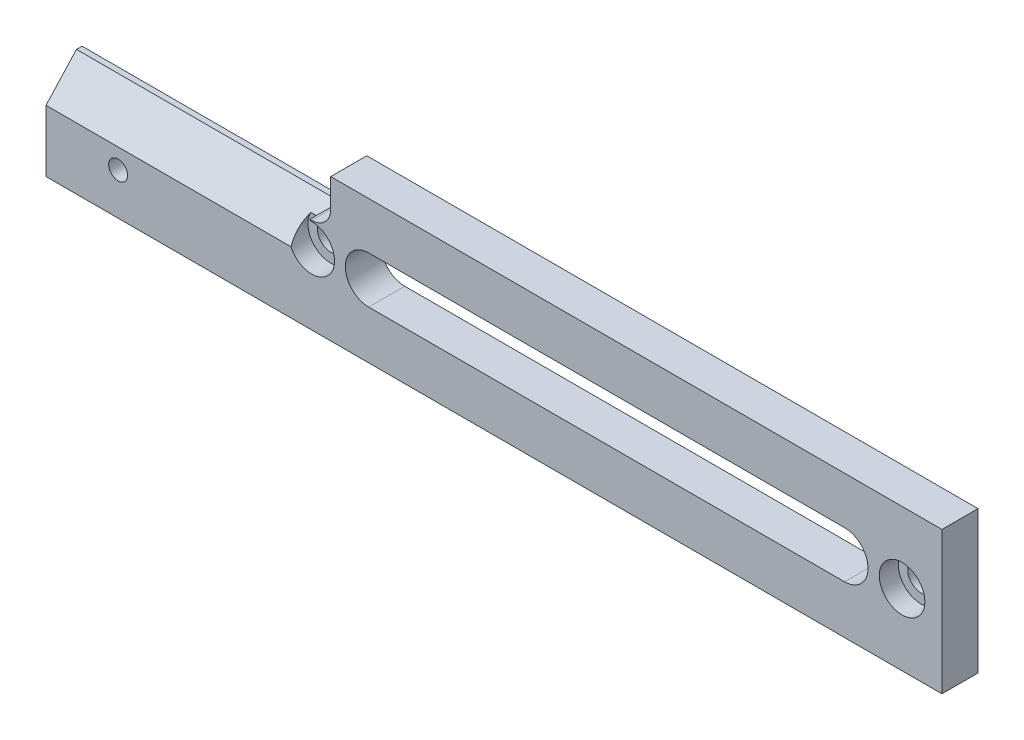
ISO-10303-21;
HEADER;
FILE_DESCRIPTION(('STEP AP214'),'2;1');
FILE_NAME('part.step','',(''),(''),'','','');
FILE_SCHEMA(('AUTOMOTIVE_DESIGN { 1 0 10303 214 1 1 1 1 }'));
ENDSEC;
DATA;
#1=APPLICATION_CONTEXT('core data for automotive mechanical design processes');
#2=APPLICATION_PROTOCOL_DEFINITION('international standard','automotive_design',2000,#1);
#3=PRODUCT_CONTEXT('',#1,'mechanical');
#4=PRODUCT('Part','Part','',(#3));
#5=PRODUCT_RELATED_PRODUCT_CATEGORY('part','',(#4));
#6=PRODUCT_DEFINITION_FORMATION('','',#4);
#7=PRODUCT_DEFINITION_CONTEXT('part definition',#1,'design');
#8=PRODUCT_DEFINITION('design','',#6,#7);
#9=PRODUCT_DEFINITION_SHAPE('','',#8);
#10=(LENGTH_UNIT() NAMED_UNIT(*) SI_UNIT(.MILLI.,.METRE.));
#11=(NAMED_UNIT(*) PLANE_ANGLE_UNIT() SI_UNIT($,.RADIAN.));
#12=(NAMED_UNIT(*) SI_UNIT($,.STERADIAN.) SOLID_ANGLE_UNIT());
#13=UNCERTAINTY_MEASURE_WITH_UNIT(LENGTH_MEASURE(1.E-05),#10,'distance_accuracy_value','');
#14=(GEOMETRIC_REPRESENTATION_CONTEXT(3) GLOBAL_UNCERTAINTY_ASSIGNED_CONTEXT((#13)) GLOBAL_UNIT_ASSIGNED_CONTEXT((#10,
#11,#12)) REPRESENTATION_CONTEXT('',''));
#15=CARTESIAN_POINT('',(0.,0.,0.));
#16=DIRECTION('',(0.,0.,1.));
#17=DIRECTION('',(1.,0.,0.));
#18=AXIS2_PLACEMENT_3D('',#15,#16,#17);
#19=CARTESIAN_POINT('',(0.,19.05,4.826));
#20=DIRECTION('',(-1.,0.,0.));
#21=DIRECTION('',(0.,-1.,0.));
#22=AXIS2_PLACEMENT_3D('',#19,#20,#21);
#23=PLANE('',#22);
#24=DIRECTION('',(0.,1.,0.));
#25=VECTOR('',#24,1.);
#26=CARTESIAN_POINT('',(0.,19.05,0.));
#27=LINE('',#26,#25);
#28=CARTESIAN_POINT('',(0.,0.,0.));
#29=VERTEX_POINT('',#28);
#30=CARTESIAN_POINT('',(0.,19.05,0.));
#31=VERTEX_POINT('',#30);
#32=EDGE_CURVE('E228',#29,#31,#27,.T.);
#33=ORIENTED_EDGE('',*,*,#32,.T.);
#34=DIRECTION('',(0.,0.,-1.));
#35=VECTOR('',#34,1.);
#36=CARTESIAN_POINT('',(0.,19.05,4.826));
#37=LINE('',#36,#35);
#38=CARTESIAN_POINT('',(0.,19.05,4.826));
#39=VERTEX_POINT('',#38);
#40=EDGE_CURVE('E278',#39,#31,#37,.T.);
#41=ORIENTED_EDGE('',*,*,#40,.F.);
#42=DIRECTION('',(0.,1.,0.));
#43=VECTOR('',#42,1.);
#44=CARTESIAN_POINT('',(0.,19.05,4.826));
#45=LINE('',#44,#43);
#46=CARTESIAN_POINT('',(0.,0.,4.826));
#47=VERTEX_POINT('',#46);
#48=EDGE_CURVE('E230',#47,#39,#45,.T.);
#49=ORIENTED_EDGE('',*,*,#48,.F.);
#50=DIRECTION('',(0.,0.,-1.));
#51=VECTOR('',#50,1.);
#52=CARTESIAN_POINT('',(0.,0.,4.826));
#53=LINE('',#52,#51);
#54=EDGE_CURVE('E247',#47,#29,#53,.T.);
#55=ORIENTED_EDGE('',*,*,#54,.T.);
#56=EDGE_LOOP('',(#33,#41,#49,#55));
#57=FACE_BOUND('',#56,.T.);
#58=ADVANCED_FACE('F33',(#57),#23,.F.);
#59=CARTESIAN_POINT('',(-81.788,19.05,4.826));
#60=DIRECTION('',(0.,-1.,0.));
#61=DIRECTION('',(0.,0.,-1.));
#62=AXIS2_PLACEMENT_3D('',#59,#60,#61);
#63=PLANE('',#62);
#64=DIRECTION('',(-1.,0.,0.));
#65=VECTOR('',#64,1.);
#66=CARTESIAN_POINT('',(-81.788,19.05,0.));
#67=LINE('',#66,#65);
#68=CARTESIAN_POINT('',(-81.788,19.05,0.));
#69=VERTEX_POINT('',#68);
#70=EDGE_CURVE('E250',#31,#69,#67,.T.);
#71=ORIENTED_EDGE('',*,*,#70,.T.);
#72=DIRECTION('',(0.,0.,-1.));
#73=VECTOR('',#72,1.);
#74=CARTESIAN_POINT('',(-81.788,19.05,4.826));
#75=LINE('',#74,#73);
#76=CARTESIAN_POINT('',(-81.788,19.05,4.826));
#77=VERTEX_POINT('',#76);
#78=EDGE_CURVE('E275',#77,#69,#75,.T.);
#79=ORIENTED_EDGE('',*,*,#78,.F.);
#80=DIRECTION('',(-1.,0.,0.));
#81=VECTOR('',#80,1.);
#82=CARTESIAN_POINT('',(-81.788,19.05,4.826));
#83=LINE('',#82,#81);
#84=EDGE_CURVE('E233',#39,#77,#83,.T.);
#85=ORIENTED_EDGE('',*,*,#84,.F.);
#86=ORIENTED_EDGE('',*,*,#40,.T.);
#87=EDGE_LOOP('',(#71,#79,#85,#86));
#88=FACE_BOUND('',#87,.T.);
#89=ADVANCED_FACE('F322',(#88),#63,.F.);
#90=CARTESIAN_POINT('',(-81.788,15.24,4.826));
#91=DIRECTION('',(1.,0.,0.));
#92=DIRECTION('',(0.,0.,-1.));
#93=AXIS2_PLACEMENT_3D('',#90,#91,#92);
#94=PLANE('',#93);
#95=DIRECTION('',(0.,-1.,0.));
#96=VECTOR('',#95,1.);
#97=CARTESIAN_POINT('',(-81.788,15.24,0.));
#98=LINE('',#97,#96);
#99=CARTESIAN_POINT('',(-81.788,15.24,0.));
#100=VERTEX_POINT('',#99);
#101=EDGE_CURVE('E252',#69,#100,#98,.T.);
#102=ORIENTED_EDGE('',*,*,#101,.T.);
#103=DIRECTION('',(0.,0.,-1.));
#104=VECTOR('',#103,1.);
#105=CARTESIAN_POINT('',(-81.788,15.24,4.826));
#106=LINE('',#105,#104);
#107=CARTESIAN_POINT('',(-81.788,15.24,4.826));
#108=VERTEX_POINT('',#107);
#109=EDGE_CURVE('E272',#108,#100,#106,.T.);
#110=ORIENTED_EDGE('',*,*,#109,.F.);
#111=DIRECTION('',(0.,-1.,0.));
#112=VECTOR('',#111,1.);
#113=CARTESIAN_POINT('',(-81.788,15.24,4.826));
#114=LINE('',#113,#112);
#115=EDGE_CURVE('E236',#77,#108,#114,.T.);
#116=ORIENTED_EDGE('',*,*,#115,.F.);
#117=ORIENTED_EDGE('',*,*,#78,.T.);
#118=EDGE_LOOP('',(#102,#110,#116,#117));
#119=FACE_BOUND('',#118,.T.);
#120=ADVANCED_FACE('F327',(#119),#94,.F.);
#121=CARTESIAN_POINT('',(-84.328,15.24,4.826));
#122=DIRECTION('',(0.,0.,-1.));
#123=DIRECTION('',(-1.,0.,0.));
#124=AXIS2_PLACEMENT_3D('',#121,#122,#123);
#125=CYLINDRICAL_SURFACE('',#124,2.54);
#126=CARTESIAN_POINT('',(-84.328,15.24,0.));
#127=DIRECTION('',(0.,0.,-1.));
#128=DIRECTION('',(1.,0.,0.));
#129=AXIS2_PLACEMENT_3D('',#126,#127,#128);
#130=CIRCLE('',#129,2.54);
#131=CARTESIAN_POINT('',(-84.328,12.7,0.));
#132=VERTEX_POINT('',#131);
#133=EDGE_CURVE('E254',#100,#132,#130,.T.);
#134=ORIENTED_EDGE('',*,*,#133,.T.);
#135=DIRECTION('',(0.,0.,-1.));
#136=VECTOR('',#135,1.);
#137=CARTESIAN_POINT('',(-84.328,12.7,4.826));
#138=LINE('',#137,#136);
#139=CARTESIAN_POINT('',(-84.328,12.7,4.826));
#140=VERTEX_POINT('',#139);
#141=EDGE_CURVE('E269',#140,#132,#138,.T.);
#142=ORIENTED_EDGE('',*,*,#141,.F.);
#143=CARTESIAN_POINT('',(-84.328,15.24,4.826));
#144=DIRECTION('',(0.,0.,-1.));
#145=DIRECTION('',(1.,0.,0.));
#146=AXIS2_PLACEMENT_3D('',#143,#144,#145);
#147=CIRCLE('',#146,2.54);
#148=EDGE_CURVE('E238',#108,#140,#147,.T.);
#149=ORIENTED_EDGE('',*,*,#148,.F.);
#150=ORIENTED_EDGE('',*,*,#109,.T.);
#151=EDGE_LOOP('',(#134,#142,#149,#150));
#152=FACE_BOUND('',#151,.T.);
#153=ADVANCED_FACE('F357',(#152),#125,.F.);
#154=CARTESIAN_POINT('',(-119.888,12.7,4.826));
#155=DIRECTION('',(0.,-1.,0.));
#156=DIRECTION('',(0.,0.,-1.));
#157=AXIS2_PLACEMENT_3D('',#154,#155,#156);
#158=PLANE('',#157);
#159=DIRECTION('',(0.,0.,-1.));
#160=VECTOR('',#159,1.);
#161=CARTESIAN_POINT('',(-119.888,12.7,4.826));
#162=LINE('',#161,#160);
#163=CARTESIAN_POINT('',(-119.888,12.7,0.749793550019733));
#164=VERTEX_POINT('',#163);
#165=CARTESIAN_POINT('',(-119.888,12.7,0.));
#166=VERTEX_POINT('',#165);
#167=EDGE_CURVE('E267',#164,#166,#162,.T.);
#168=ORIENTED_EDGE('',*,*,#167,.F.);
#169=DIRECTION('',(-1.,0.,0.));
#170=VECTOR('',#169,1.);
#171=CARTESIAN_POINT('',(-84.582,12.7,0.749793550019733));
#172=LINE('',#171,#170);
#173=CARTESIAN_POINT('',(-84.582,12.7,0.749793550019733));
#174=VERTEX_POINT('',#173);
#175=EDGE_CURVE('E223',#174,#164,#172,.T.);
#176=ORIENTED_EDGE('',*,*,#175,.F.);
#177=DIRECTION('',(0.,0.,-1.));
#178=VECTOR('',#177,1.);
#179=CARTESIAN_POINT('',(-84.582,12.7,4.826));
#180=LINE('',#179,#178);
#181=CARTESIAN_POINT('',(-84.582,12.7,4.826));
#182=VERTEX_POINT('',#181);
#183=EDGE_CURVE('E215',#182,#174,#180,.T.);
#184=ORIENTED_EDGE('',*,*,#183,.F.);
#185=DIRECTION('',(-1.,0.,0.));
#186=VECTOR('',#185,1.);
#187=CARTESIAN_POINT('',(-119.888,12.7,4.826));
#188=LINE('',#187,#186);
#189=EDGE_CURVE('E240',#140,#182,#188,.T.);
#190=ORIENTED_EDGE('',*,*,#189,.F.);
#191=ORIENTED_EDGE('',*,*,#141,.T.);
#192=DIRECTION('',(-1.,0.,0.));
#193=VECTOR('',#192,1.);
#194=CARTESIAN_POINT('',(-119.888,12.7,0.));
#195=LINE('',#194,#193);
#196=EDGE_CURVE('E256',#132,#166,#195,.T.);
#197=ORIENTED_EDGE('',*,*,#196,.T.);
#198=EDGE_LOOP('',(#168,#176,#184,#190,#191,#197));
#199=FACE_BOUND('',#198,.T.);
#200=ADVANCED_FACE('F350',(#199),#158,.F.);
#201=CARTESIAN_POINT('',(-119.888,0.,4.826));
#202=DIRECTION('',(1.,0.,0.));
#203=DIRECTION('',(0.,0.,-1.));
#204=AXIS2_PLACEMENT_3D('',#201,#202,#203);
#205=PLANE('',#204);
#206=DIRECTION('',(0.,-1.,0.));
#207=VECTOR('',#206,1.);
#208=CARTESIAN_POINT('',(-119.888,0.,4.826));
#209=LINE('',#208,#207);
#210=CARTESIAN_POINT('',(-119.888,8.25869508921998,4.826));
#211=VERTEX_POINT('',#210);
#212=CARTESIAN_POINT('',(-119.888,0.,4.826));
#213=VERTEX_POINT('',#212);
#214=EDGE_CURVE('E243',#211,#213,#209,.T.);
#215=ORIENTED_EDGE('',*,*,#214,.F.);
#216=DIRECTION('',(0.,-0.736740008018432,0.676176131333398));
#217=VECTOR('',#216,1.);
#218=CARTESIAN_POINT('',(-119.888,12.7,0.749793550019733));
#219=LINE('',#218,#217);
#220=EDGE_CURVE('E212',#164,#211,#219,.T.);
#221=ORIENTED_EDGE('',*,*,#220,.F.);
#222=ORIENTED_EDGE('',*,*,#167,.T.);
#223=DIRECTION('',(0.,-1.,0.));
#224=VECTOR('',#223,1.);
#225=CARTESIAN_POINT('',(-119.888,0.,0.));
#226=LINE('',#225,#224);
#227=CARTESIAN_POINT('',(-119.888,0.,0.));
#228=VERTEX_POINT('',#227);
#229=EDGE_CURVE('E259',#166,#228,#226,.T.);
#230=ORIENTED_EDGE('',*,*,#229,.T.);
#231=DIRECTION('',(0.,0.,-1.));
#232=VECTOR('',#231,1.);
#233=CARTESIAN_POINT('',(-119.888,0.,4.826));
#234=LINE('',#233,#232);
#235=EDGE_CURVE('E264',#213,#228,#234,.T.);
#236=ORIENTED_EDGE('',*,*,#235,.F.);
#237=EDGE_LOOP('',(#215,#221,#222,#230,#236));
#238=FACE_BOUND('',#237,.T.);
#239=ADVANCED_FACE('F316',(#238),#205,.F.);
#240=CARTESIAN_POINT('',(0.,0.,4.826));
#241=DIRECTION('',(0.,1.,0.));
#242=DIRECTION('',(-1.,0.,0.));
#243=AXIS2_PLACEMENT_3D('',#240,#241,#242);
#244=PLANE('',#243);
#245=DIRECTION('',(1.,0.,0.));
#246=VECTOR('',#245,1.);
#247=CARTESIAN_POINT('',(0.,0.,0.));
#248=LINE('',#247,#246);
#249=EDGE_CURVE('E234',#228,#29,#248,.T.);
#250=ORIENTED_EDGE('',*,*,#249,.T.);
#251=ORIENTED_EDGE('',*,*,#54,.F.);
#252=DIRECTION('',(1.,0.,0.));
#253=VECTOR('',#252,1.);
#254=CARTESIAN_POINT('',(0.,0.,4.826));
#255=LINE('',#254,#253);
#256=EDGE_CURVE('E245',#213,#47,#255,.T.);
#257=ORIENTED_EDGE('',*,*,#256,.F.);
#258=ORIENTED_EDGE('',*,*,#235,.T.);
#259=EDGE_LOOP('',(#250,#251,#257,#258));
#260=FACE_BOUND('',#259,.T.);
#261=ADVANCED_FACE('F307',(#260),#244,.F.);
#262=CARTESIAN_POINT('',(-84.328,15.24,4.826));
#263=DIRECTION('',(0.,0.,1.));
#264=DIRECTION('',(1.,0.,0.));
#265=AXIS2_PLACEMENT_3D('',#262,#263,#264);
#266=PLANE('',#265);
#267=CARTESIAN_POINT('',(-76.708,9.60500702074697,4.826));
#268=DIRECTION('',(0.,0.,1.));
#269=DIRECTION('',(1.,0.,0.));
#270=AXIS2_PLACEMENT_3D('',#267,#268,#269);
#271=CIRCLE('',#270,3.1369);
#272=CARTESIAN_POINT('',(-76.708,12.741907020747,4.826));
#273=VERTEX_POINT('',#272);
#274=CARTESIAN_POINT('',(-76.708,6.46810702074696,4.826));
#275=VERTEX_POINT('',#274);
#276=EDGE_CURVE('E47',#273,#275,#271,.T.);
#277=ORIENTED_EDGE('',*,*,#276,.F.);
#278=DIRECTION('',(-1.,0.,0.));
#279=VECTOR('',#278,1.);
#280=CARTESIAN_POINT('',(-76.708,12.741907020747,4.826));
#281=LINE('',#280,#279);
#282=CARTESIAN_POINT('',(-13.0302,12.741907020747,4.826));
#283=VERTEX_POINT('',#282);
#284=EDGE_CURVE('E162',#283,#273,#281,.T.);
#285=ORIENTED_EDGE('',*,*,#284,.F.);
#286=CARTESIAN_POINT('',(-13.0302,9.60500702074698,4.826));
#287=DIRECTION('',(0.,0.,1.));
#288=DIRECTION('',(1.,0.,0.));
#289=AXIS2_PLACEMENT_3D('',#286,#287,#288);
#290=CIRCLE('',#289,3.1369);
#291=CARTESIAN_POINT('',(-13.0302,6.46810702074698,4.826));
#292=VERTEX_POINT('',#291);
#293=EDGE_CURVE('E165',#292,#283,#290,.T.);
#294=ORIENTED_EDGE('',*,*,#293,.F.);
#295=DIRECTION('',(1.,0.,0.));
#296=VECTOR('',#295,1.);
#297=CARTESIAN_POINT('',(-13.0302,6.46810702074697,4.826));
#298=LINE('',#297,#296);
#299=EDGE_CURVE('E171',#275,#292,#298,.T.);
#300=ORIENTED_EDGE('',*,*,#299,.F.);
#301=EDGE_LOOP('',(#277,#285,#294,#300));
#302=FACE_BOUND('',#301,.T.);
#303=CARTESIAN_POINT('',(-110.236,5.58799999999998,4.826));
#304=DIRECTION('',(0.,0.,1.));
#305=DIRECTION('',(1.,0.,0.));
#306=AXIS2_PLACEMENT_3D('',#303,#304,#305);
#307=CIRCLE('',#306,1.26999999999999);
#308=CARTESIAN_POINT('',(-108.966,5.58799999999998,4.826));
#309=VERTEX_POINT('',#308);
#310=EDGE_CURVE('E177',#309,#309,#307,.T.);
#311=ORIENTED_EDGE('',*,*,#310,.F.);
#312=EDGE_LOOP('',(#311));
#313=FACE_BOUND('',#312,.T.);
#314=CARTESIAN_POINT('',(-84.328,9.525,4.826));
#315=DIRECTION('',(0.,0.,1.));
#316=DIRECTION('',(1.,0.,0.));
#317=AXIS2_PLACEMENT_3D('',#314,#315,#316);
#318=CIRCLE('',#317,3.048);
#319=CARTESIAN_POINT('',(-87.1005035388498,8.25869508921998,4.826));
#320=VERTEX_POINT('',#319);
#321=CARTESIAN_POINT('',(-84.582,12.5623982287478,4.826));
#322=VERTEX_POINT('',#321);
#323=EDGE_CURVE('E202',#320,#322,#318,.T.);
#324=ORIENTED_EDGE('',*,*,#323,.F.);
#325=DIRECTION('',(-1.,0.,0.));
#326=VECTOR('',#325,1.);
#327=CARTESIAN_POINT('',(-84.582,8.25869508921998,4.826));
#328=LINE('',#327,#326);
#329=EDGE_CURVE('E226',#320,#211,#328,.T.);
#330=ORIENTED_EDGE('',*,*,#329,.T.);
#331=ORIENTED_EDGE('',*,*,#214,.T.);
#332=ORIENTED_EDGE('',*,*,#256,.T.);
#333=ORIENTED_EDGE('',*,*,#48,.T.);
#334=ORIENTED_EDGE('',*,*,#84,.T.);
#335=ORIENTED_EDGE('',*,*,#115,.T.);
#336=ORIENTED_EDGE('',*,*,#148,.T.);
#337=ORIENTED_EDGE('',*,*,#189,.T.);
#338=DIRECTION('',(0.,1.,0.));
#339=VECTOR('',#338,1.);
#340=CARTESIAN_POINT('',(-84.582,8.25869508921998,4.826));
#341=LINE('',#340,#339);
#342=EDGE_CURVE('E221',#322,#182,#341,.T.);
#343=ORIENTED_EDGE('',*,*,#342,.F.);
#344=EDGE_LOOP('',(#324,#330,#331,#332,#333,#334,#335,#336,#337,#343));
#345=FACE_BOUND('',#344,.T.);
#346=CARTESIAN_POINT('',(-5.334,9.525,4.826));
#347=DIRECTION('',(0.,0.,1.));
#348=DIRECTION('',(1.,0.,0.));
#349=AXIS2_PLACEMENT_3D('',#346,#347,#348);
#350=CIRCLE('',#349,3.048);
#351=CARTESIAN_POINT('',(-2.286,9.525,4.826));
#352=VERTEX_POINT('',#351);
#353=EDGE_CURVE('E208',#352,#352,#350,.T.);
#354=ORIENTED_EDGE('',*,*,#353,.F.);
#355=EDGE_LOOP('',(#354));
#356=FACE_BOUND('',#355,.T.);
#357=ADVANCED_FACE('F305',(#302,#313,#345,#356),#266,.T.);
#358=CARTESIAN_POINT('',(-84.328,15.24,0.));
#359=DIRECTION('',(0.,0.,1.));
#360=DIRECTION('',(1.,0.,0.));
#361=AXIS2_PLACEMENT_3D('',#358,#359,#360);
#362=PLANE('',#361);
#363=DIRECTION('',(-1.,0.,0.));
#364=VECTOR('',#363,1.);
#365=CARTESIAN_POINT('',(-76.708,12.741907020747,0.));
#366=LINE('',#365,#364);
#367=CARTESIAN_POINT('',(-13.0302,12.741907020747,0.));
#368=VERTEX_POINT('',#367);
#369=CARTESIAN_POINT('',(-76.708,12.741907020747,0.));
#370=VERTEX_POINT('',#369);
#371=EDGE_CURVE('E152',#368,#370,#366,.T.);
#372=ORIENTED_EDGE('',*,*,#371,.T.);
#373=CARTESIAN_POINT('',(-76.708,9.60500702074697,0.));
#374=DIRECTION('',(0.,0.,1.));
#375=DIRECTION('',(1.,0.,0.));
#376=AXIS2_PLACEMENT_3D('',#373,#374,#375);
#377=CIRCLE('',#376,3.1369);
#378=CARTESIAN_POINT('',(-76.708,6.46810702074696,0.));
#379=VERTEX_POINT('',#378);
#380=EDGE_CURVE('E146',#370,#379,#377,.T.);
#381=ORIENTED_EDGE('',*,*,#380,.T.);
#382=DIRECTION('',(1.,0.,0.));
#383=VECTOR('',#382,1.);
#384=CARTESIAN_POINT('',(-13.0302,6.46810702074697,0.));
#385=LINE('',#384,#383);
#386=CARTESIAN_POINT('',(-13.0302,6.46810702074697,0.));
#387=VERTEX_POINT('',#386);
#388=EDGE_CURVE('E155',#379,#387,#385,.T.);
#389=ORIENTED_EDGE('',*,*,#388,.T.);
#390=CARTESIAN_POINT('',(-13.0302,9.60500702074698,0.));
#391=DIRECTION('',(0.,0.,1.));
#392=DIRECTION('',(1.,0.,0.));
#393=AXIS2_PLACEMENT_3D('',#390,#391,#392);
#394=CIRCLE('',#393,3.1369);
#395=EDGE_CURVE('E55',#387,#368,#394,.T.);
#396=ORIENTED_EDGE('',*,*,#395,.T.);
#397=EDGE_LOOP('',(#372,#381,#389,#396));
#398=FACE_BOUND('',#397,.T.);
#399=CARTESIAN_POINT('',(-110.236,5.58799999999998,0.));
#400=DIRECTION('',(0.,0.,1.));
#401=DIRECTION('',(1.,0.,0.));
#402=AXIS2_PLACEMENT_3D('',#399,#400,#401);
#403=CIRCLE('',#402,1.26999999999999);
#404=CARTESIAN_POINT('',(-108.966,5.58799999999998,0.));
#405=VERTEX_POINT('',#404);
#406=EDGE_CURVE('E181',#405,#405,#403,.T.);
#407=ORIENTED_EDGE('',*,*,#406,.T.);
#408=EDGE_LOOP('',(#407));
#409=FACE_BOUND('',#408,.T.);
#410=CARTESIAN_POINT('',(-84.328,9.525,0.));
#411=DIRECTION('',(0.,0.,1.));
#412=DIRECTION('',(1.,0.,0.));
#413=AXIS2_PLACEMENT_3D('',#410,#411,#412);
#414=CIRCLE('',#413,1.77800000000001);
#415=CARTESIAN_POINT('',(-82.55,9.525,0.));
#416=VERTEX_POINT('',#415);
#417=EDGE_CURVE('E184',#416,#416,#414,.T.);
#418=ORIENTED_EDGE('',*,*,#417,.T.);
#419=EDGE_LOOP('',(#418));
#420=FACE_BOUND('',#419,.T.);
#421=CARTESIAN_POINT('',(-5.334,9.525,0.));
#422=DIRECTION('',(0.,0.,1.));
#423=DIRECTION('',(1.,0.,0.));
#424=AXIS2_PLACEMENT_3D('',#421,#422,#423);
#425=CIRCLE('',#424,1.778);
#426=CARTESIAN_POINT('',(-3.556,9.525,0.));
#427=VERTEX_POINT('',#426);
#428=EDGE_CURVE('E195',#427,#427,#425,.T.);
#429=ORIENTED_EDGE('',*,*,#428,.T.);
#430=EDGE_LOOP('',(#429));
#431=FACE_BOUND('',#430,.T.);
#432=ORIENTED_EDGE('',*,*,#32,.F.);
#433=ORIENTED_EDGE('',*,*,#249,.F.);
#434=ORIENTED_EDGE('',*,*,#229,.F.);
#435=ORIENTED_EDGE('',*,*,#196,.F.);
#436=ORIENTED_EDGE('',*,*,#133,.F.);
#437=ORIENTED_EDGE('',*,*,#101,.F.);
#438=ORIENTED_EDGE('',*,*,#70,.F.);
#439=EDGE_LOOP('',(#432,#433,#434,#435,#436,#437,#438));
#440=FACE_BOUND('',#439,.T.);
#441=ADVANCED_FACE('F159',(#398,#409,#420,#431,#440),#362,.F.);
#442=CARTESIAN_POINT('',(-84.582,12.7,0.749793550019733));
#443=DIRECTION('',(0.,-0.676176131333398,-0.736740008018432));
#444=DIRECTION('',(0.,0.736740008018432,-0.676176131333398));
#445=AXIS2_PLACEMENT_3D('',#442,#443,#444);
#446=PLANE('',#445);
#447=DIRECTION('',(-1.,0.,0.));
#448=VECTOR('',#447,1.);
#449=CARTESIAN_POINT('',(-84.582,11.0261983086499,2.286));
#450=LINE('',#449,#448);
#451=CARTESIAN_POINT('',(-85.2807264235376,11.0261983086499,2.286));
#452=VERTEX_POINT('',#451);
#453=CARTESIAN_POINT('',(-86.980679331941,11.0261983086499,2.286));
#454=VERTEX_POINT('',#453);
#455=EDGE_CURVE('E201',#452,#454,#450,.T.);
#456=ORIENTED_EDGE('',*,*,#455,.F.);
#457=CARTESIAN_POINT('',(-84.328,9.525,3.66379196685312));
#458=DIRECTION('',(0.,-0.676176131333398,-0.736740008018432));
#459=DIRECTION('',(0.,-0.736740008018432,0.676176131333398));
#460=AXIS2_PLACEMENT_3D('',#457,#458,#459);
#461=ELLIPSE('',#460,2.41333439293217,1.77800000000001);
#462=CARTESIAN_POINT('',(-84.582,11.28476362049,2.04869010729128));
#463=VERTEX_POINT('',#462);
#464=EDGE_CURVE('E192',#452,#463,#461,.T.);
#465=ORIENTED_EDGE('',*,*,#464,.T.);
#466=DIRECTION('',(0.,-0.736740008018432,0.676176131333398));
#467=VECTOR('',#466,1.);
#468=CARTESIAN_POINT('',(-84.582,12.7,0.749793550019733));
#469=LINE('',#468,#467);
#470=EDGE_CURVE('E218',#174,#463,#469,.T.);
#471=ORIENTED_EDGE('',*,*,#470,.F.);
#472=ORIENTED_EDGE('',*,*,#175,.T.);
#473=ORIENTED_EDGE('',*,*,#220,.T.);
#474=ORIENTED_EDGE('',*,*,#329,.F.);
#475=CARTESIAN_POINT('',(-84.328,9.525,3.66379196685312));
#476=DIRECTION('',(0.,-0.676176131333398,-0.736740008018432));
#477=DIRECTION('',(0.,-0.736740008018432,0.676176131333398));
#478=AXIS2_PLACEMENT_3D('',#475,#476,#477);
#479=ELLIPSE('',#478,4.13714467359799,3.048);
#480=EDGE_CURVE('E205',#320,#454,#479,.T.);
#481=ORIENTED_EDGE('',*,*,#480,.T.);
#482=EDGE_LOOP('',(#456,#465,#471,#472,#473,#474,#481));
#483=FACE_BOUND('',#482,.T.);
#484=ADVANCED_FACE('F314',(#483),#446,.F.);
#485=CARTESIAN_POINT('',(-84.582,0.,0.));
#486=DIRECTION('',(1.,0.,0.));
#487=DIRECTION('',(0.,0.,-1.));
#488=AXIS2_PLACEMENT_3D('',#485,#486,#487);
#489=PLANE('',#488);
#490=ORIENTED_EDGE('',*,*,#470,.T.);
#491=DIRECTION('',(0.,0.,1.));
#492=VECTOR('',#491,1.);
#493=CARTESIAN_POINT('',(-84.582,11.28476362049,0.));
#494=LINE('',#493,#492);
#495=CARTESIAN_POINT('',(-84.582,11.28476362049,2.286));
#496=VERTEX_POINT('',#495);
#497=EDGE_CURVE('E189',#463,#496,#494,.T.);
#498=ORIENTED_EDGE('',*,*,#497,.T.);
#499=DIRECTION('',(0.,-1.,0.));
#500=VECTOR('',#499,1.);
#501=CARTESIAN_POINT('',(-84.582,0.,2.286));
#502=LINE('',#501,#500);
#503=CARTESIAN_POINT('',(-84.582,12.5623982287478,2.286));
#504=VERTEX_POINT('',#503);
#505=EDGE_CURVE('E281',#504,#496,#502,.T.);
#506=ORIENTED_EDGE('',*,*,#505,.F.);
#507=DIRECTION('',(0.,0.,1.));
#508=VECTOR('',#507,1.);
#509=CARTESIAN_POINT('',(-84.582,12.5623982287478,2.286));
#510=LINE('',#509,#508);
#511=EDGE_CURVE('E40',#504,#322,#510,.T.);
#512=ORIENTED_EDGE('',*,*,#511,.T.);
#513=ORIENTED_EDGE('',*,*,#342,.T.);
#514=ORIENTED_EDGE('',*,*,#183,.T.);
#515=EDGE_LOOP('',(#490,#498,#506,#512,#513,#514));
#516=FACE_BOUND('',#515,.T.);
#517=ADVANCED_FACE('F301',(#516),#489,.F.);
#518=CARTESIAN_POINT('',(-5.334,9.525,2.286));
#519=DIRECTION('',(0.,0.,1.));
#520=DIRECTION('',(1.,0.,0.));
#521=AXIS2_PLACEMENT_3D('',#518,#519,#520);
#522=CYLINDRICAL_SURFACE('',#521,3.048);
#523=CARTESIAN_POINT('',(-5.334,9.525,2.286));
#524=DIRECTION('',(0.,0.,1.));
#525=DIRECTION('',(1.,0.,0.));
#526=AXIS2_PLACEMENT_3D('',#523,#524,#525);
#527=CIRCLE('',#526,3.048);
#528=CARTESIAN_POINT('',(-2.286,9.525,2.286));
#529=VERTEX_POINT('',#528);
#530=EDGE_CURVE('E209',#529,#529,#527,.T.);
#531=ORIENTED_EDGE('',*,*,#530,.F.);
#532=EDGE_LOOP('',(#531));
#533=FACE_BOUND('',#532,.T.);
#534=ORIENTED_EDGE('',*,*,#353,.T.);
#535=EDGE_LOOP('',(#534));
#536=FACE_BOUND('',#535,.T.);
#537=ADVANCED_FACE('F295',(#533,#536),#522,.F.);
#538=CARTESIAN_POINT('',(-5.334,9.525,2.286));
#539=DIRECTION('',(0.,0.,1.));
#540=DIRECTION('',(1.,0.,0.));
#541=AXIS2_PLACEMENT_3D('',#538,#539,#540);
#542=PLANE('',#541);
#543=CARTESIAN_POINT('',(-5.334,9.525,2.286));
#544=DIRECTION('',(0.,0.,1.));
#545=DIRECTION('',(1.,0.,0.));
#546=AXIS2_PLACEMENT_3D('',#543,#544,#545);
#547=CIRCLE('',#546,1.778);
#548=CARTESIAN_POINT('',(-3.556,9.525,2.286));
#549=VERTEX_POINT('',#548);
#550=EDGE_CURVE('E198',#549,#549,#547,.T.);
#551=ORIENTED_EDGE('',*,*,#550,.F.);
#552=EDGE_LOOP('',(#551));
#553=FACE_BOUND('',#552,.T.);
#554=ORIENTED_EDGE('',*,*,#530,.T.);
#555=EDGE_LOOP('',(#554));
#556=FACE_BOUND('',#555,.T.);
#557=ADVANCED_FACE('F291',(#553,#556),#542,.T.);
#558=CARTESIAN_POINT('',(-84.328,9.525,2.286));
#559=DIRECTION('',(0.,0.,1.));
#560=DIRECTION('',(1.,0.,0.));
#561=AXIS2_PLACEMENT_3D('',#558,#559,#560);
#562=CYLINDRICAL_SURFACE('',#561,3.048);
#563=ORIENTED_EDGE('',*,*,#323,.T.);
#564=ORIENTED_EDGE('',*,*,#511,.F.);
#565=CARTESIAN_POINT('',(-84.328,9.525,2.286));
#566=DIRECTION('',(0.,0.,1.));
#567=DIRECTION('',(1.,0.,0.));
#568=AXIS2_PLACEMENT_3D('',#565,#566,#567);
#569=CIRCLE('',#568,3.048);
#570=EDGE_CURVE('E199',#454,#504,#569,.T.);
#571=ORIENTED_EDGE('',*,*,#570,.F.);
#572=ORIENTED_EDGE('',*,*,#480,.F.);
#573=EDGE_LOOP('',(#563,#564,#571,#572));
#574=FACE_BOUND('',#573,.T.);
#575=ADVANCED_FACE('F294',(#574),#562,.F.);
#576=CARTESIAN_POINT('',(-84.328,9.525,2.286));
#577=DIRECTION('',(0.,0.,1.));
#578=DIRECTION('',(1.,0.,0.));
#579=AXIS2_PLACEMENT_3D('',#576,#577,#578);
#580=PLANE('',#579);
#581=CARTESIAN_POINT('',(-84.328,9.525,2.286));
#582=DIRECTION('',(0.,0.,1.));
#583=DIRECTION('',(1.,0.,0.));
#584=AXIS2_PLACEMENT_3D('',#581,#582,#583);
#585=CIRCLE('',#584,1.77800000000001);
#586=EDGE_CURVE('E11',#452,#496,#585,.T.);
#587=ORIENTED_EDGE('',*,*,#586,.F.);
#588=ORIENTED_EDGE('',*,*,#455,.T.);
#589=ORIENTED_EDGE('',*,*,#570,.T.);
#590=ORIENTED_EDGE('',*,*,#505,.T.);
#591=EDGE_LOOP('',(#587,#588,#589,#590));
#592=FACE_BOUND('',#591,.T.);
#593=ADVANCED_FACE('F370',(#592),#580,.T.);
#594=CARTESIAN_POINT('',(-5.334,9.525,0.));
#595=DIRECTION('',(0.,0.,1.));
#596=DIRECTION('',(1.,0.,0.));
#597=AXIS2_PLACEMENT_3D('',#594,#595,#596);
#598=CYLINDRICAL_SURFACE('',#597,1.778);
#599=ORIENTED_EDGE('',*,*,#550,.T.);
#600=EDGE_LOOP('',(#599));
#601=FACE_BOUND('',#600,.T.);
#602=ORIENTED_EDGE('',*,*,#428,.F.);
#603=EDGE_LOOP('',(#602));
#604=FACE_BOUND('',#603,.T.);
#605=ADVANCED_FACE('F288',(#601,#604),#598,.F.);
#606=CARTESIAN_POINT('',(-84.328,9.525,0.));
#607=DIRECTION('',(0.,0.,1.));
#608=DIRECTION('',(1.,0.,0.));
#609=AXIS2_PLACEMENT_3D('',#606,#607,#608);
#610=CYLINDRICAL_SURFACE('',#609,1.77800000000001);
#611=ORIENTED_EDGE('',*,*,#417,.F.);
#612=EDGE_LOOP('',(#611));
#613=FACE_BOUND('',#612,.T.);
#614=ORIENTED_EDGE('',*,*,#586,.T.);
#615=ORIENTED_EDGE('',*,*,#497,.F.);
#616=ORIENTED_EDGE('',*,*,#464,.F.);
#617=EDGE_LOOP('',(#614,#615,#616));
#618=FACE_BOUND('',#617,.T.);
#619=ADVANCED_FACE('F416',(#613,#618),#610,.F.);
#620=CARTESIAN_POINT('',(-110.236,5.58799999999998,0.));
#621=DIRECTION('',(0.,0.,1.));
#622=DIRECTION('',(1.,0.,0.));
#623=AXIS2_PLACEMENT_3D('',#620,#621,#622);
#624=CYLINDRICAL_SURFACE('',#623,1.26999999999999);
#625=ORIENTED_EDGE('',*,*,#406,.F.);
#626=EDGE_LOOP('',(#625));
#627=FACE_BOUND('',#626,.T.);
#628=ORIENTED_EDGE('',*,*,#310,.T.);
#629=EDGE_LOOP('',(#628));
#630=FACE_BOUND('',#629,.T.);
#631=ADVANCED_FACE('F424',(#627,#630),#624,.F.);
#632=CARTESIAN_POINT('',(-76.708,9.60500702074697,0.));
#633=DIRECTION('',(0.,0.,1.));
#634=DIRECTION('',(1.,0.,0.));
#635=AXIS2_PLACEMENT_3D('',#632,#633,#634);
#636=CYLINDRICAL_SURFACE('',#635,3.1369);
#637=ORIENTED_EDGE('',*,*,#276,.T.);
#638=DIRECTION('',(0.,0.,1.));
#639=VECTOR('',#638,1.);
#640=CARTESIAN_POINT('',(-76.708,6.46810702074696,0.));
#641=LINE('',#640,#639);
#642=EDGE_CURVE('E142',#379,#275,#641,.T.);
#643=ORIENTED_EDGE('',*,*,#642,.F.);
#644=ORIENTED_EDGE('',*,*,#380,.F.);
#645=DIRECTION('',(0.,0.,1.));
#646=VECTOR('',#645,1.);
#647=CARTESIAN_POINT('',(-76.708,12.741907020747,0.));
#648=LINE('',#647,#646);
#649=EDGE_CURVE('E175',#370,#273,#648,.T.);
#650=ORIENTED_EDGE('',*,*,#649,.T.);
#651=EDGE_LOOP('',(#637,#643,#644,#650));
#652=FACE_BOUND('',#651,.T.);
#653=ADVANCED_FACE('F144',(#652),#636,.F.);
#654=CARTESIAN_POINT('',(-76.708,12.741907020747,0.));
#655=DIRECTION('',(0.,1.,0.));
#656=DIRECTION('',(0.,0.,1.));
#657=AXIS2_PLACEMENT_3D('',#654,#655,#656);
#658=PLANE('',#657);
#659=ORIENTED_EDGE('',*,*,#284,.T.);
#660=ORIENTED_EDGE('',*,*,#649,.F.);
#661=ORIENTED_EDGE('',*,*,#371,.F.);
#662=DIRECTION('',(0.,0.,1.));
#663=VECTOR('',#662,1.);
#664=CARTESIAN_POINT('',(-13.0302,12.741907020747,0.));
#665=LINE('',#664,#663);
#666=EDGE_CURVE('E178',#368,#283,#665,.T.);
#667=ORIENTED_EDGE('',*,*,#666,.T.);
#668=EDGE_LOOP('',(#659,#660,#661,#667));
#669=FACE_BOUND('',#668,.T.);
#670=ADVANCED_FACE('F452',(#669),#658,.F.);
#671=CARTESIAN_POINT('',(-13.0302,9.60500702074698,0.));
#672=DIRECTION('',(0.,0.,1.));
#673=DIRECTION('',(1.,0.,0.));
#674=AXIS2_PLACEMENT_3D('',#671,#672,#673);
#675=CYLINDRICAL_SURFACE('',#674,3.1369);
#676=ORIENTED_EDGE('',*,*,#293,.T.);
#677=ORIENTED_EDGE('',*,*,#666,.F.);
#678=ORIENTED_EDGE('',*,*,#395,.F.);
#679=DIRECTION('',(0.,0.,1.));
#680=VECTOR('',#679,1.);
#681=CARTESIAN_POINT('',(-13.0302,6.46810702074698,0.));
#682=LINE('',#681,#680);
#683=EDGE_CURVE('E151',#387,#292,#682,.T.);
#684=ORIENTED_EDGE('',*,*,#683,.T.);
#685=EDGE_LOOP('',(#676,#677,#678,#684));
#686=FACE_BOUND('',#685,.T.);
#687=ADVANCED_FACE('F461',(#686),#675,.F.);
#688=CARTESIAN_POINT('',(-13.0302,6.46810702074697,0.));
#689=DIRECTION('',(0.,-1.,0.));
#690=DIRECTION('',(1.,0.,0.));
#691=AXIS2_PLACEMENT_3D('',#688,#689,#690);
#692=PLANE('',#691);
#693=ORIENTED_EDGE('',*,*,#299,.T.);
#694=ORIENTED_EDGE('',*,*,#683,.F.);
#695=ORIENTED_EDGE('',*,*,#388,.F.);
#696=ORIENTED_EDGE('',*,*,#642,.T.);
#697=EDGE_LOOP('',(#693,#694,#695,#696));
#698=FACE_BOUND('',#697,.T.);
#699=ADVANCED_FACE('F156',(#698),#692,.F.);
#700=CLOSED_SHELL('',(#58,#89,#120,#153,#200,#239,#261,#357,#441,#484,#517,#537,#557,#575,#593,
#605,#619,#631,#653,#670,#687,#699));
#701=MANIFOLD_SOLID_BREP('B2',#700);
#702=ADVANCED_BREP_SHAPE_REPRESENTATION('',(#18,#701),#14);
#703=SHAPE_DEFINITION_REPRESENTATION(#9,#702);
ENDSEC;
END-ISO-10303-21;
